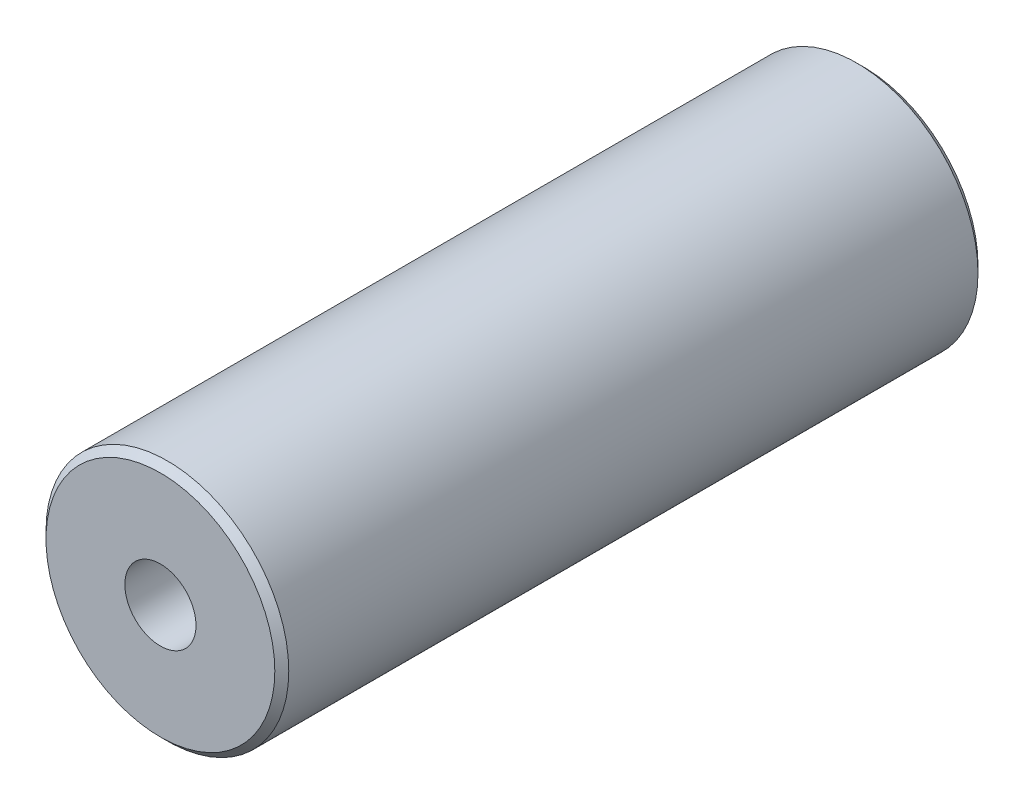
ISO-10303-21;
HEADER;
FILE_DESCRIPTION(('STEP AP214'),'2;1');
FILE_NAME('part.step','',(''),(''),'','','');
FILE_SCHEMA(('AUTOMOTIVE_DESIGN { 1 0 10303 214 1 1 1 1 }'));
ENDSEC;
DATA;
#1=APPLICATION_CONTEXT('core data for automotive mechanical design processes');
#2=APPLICATION_PROTOCOL_DEFINITION('international standard','automotive_design',2000,#1);
#3=PRODUCT_CONTEXT('',#1,'mechanical');
#4=PRODUCT('Part','Part','',(#3));
#5=PRODUCT_RELATED_PRODUCT_CATEGORY('part','',(#4));
#6=PRODUCT_DEFINITION_FORMATION('','',#4);
#7=PRODUCT_DEFINITION_CONTEXT('part definition',#1,'design');
#8=PRODUCT_DEFINITION('design','',#6,#7);
#9=PRODUCT_DEFINITION_SHAPE('','',#8);
#10=(LENGTH_UNIT() NAMED_UNIT(*) SI_UNIT(.MILLI.,.METRE.));
#11=(NAMED_UNIT(*) PLANE_ANGLE_UNIT() SI_UNIT($,.RADIAN.));
#12=(NAMED_UNIT(*) SI_UNIT($,.STERADIAN.) SOLID_ANGLE_UNIT());
#13=UNCERTAINTY_MEASURE_WITH_UNIT(LENGTH_MEASURE(1.E-05),#10,'distance_accuracy_value','');
#14=(GEOMETRIC_REPRESENTATION_CONTEXT(3) GLOBAL_UNCERTAINTY_ASSIGNED_CONTEXT((#13)) GLOBAL_UNIT_ASSIGNED_CONTEXT((#10,
#11,#12)) REPRESENTATION_CONTEXT('',''));
#15=CARTESIAN_POINT('',(0.,0.,0.));
#16=DIRECTION('',(0.,0.,1.));
#17=DIRECTION('',(1.,0.,0.));
#18=AXIS2_PLACEMENT_3D('',#15,#16,#17);
#19=CARTESIAN_POINT('',(0.,0.,25.2));
#20=DIRECTION('',(0.,0.,1.));
#21=DIRECTION('',(1.,0.,0.));
#22=AXIS2_PLACEMENT_3D('',#19,#20,#21);
#23=PLANE('',#22);
#24=CARTESIAN_POINT('',(0.,0.,25.2));
#25=DIRECTION('',(0.,0.,1.));
#26=DIRECTION('',(1.,0.,0.));
#27=AXIS2_PLACEMENT_3D('',#24,#25,#26);
#28=CIRCLE('',#27,8.2);
#29=CARTESIAN_POINT('',(8.2,0.,25.2));
#30=VERTEX_POINT('',#29);
#31=EDGE_CURVE('E10',#30,#30,#28,.T.);
#32=ORIENTED_EDGE('',*,*,#31,.T.);
#33=EDGE_LOOP('',(#32));
#34=FACE_BOUND('',#33,.T.);
#35=CARTESIAN_POINT('',(0.,0.,25.2));
#36=DIRECTION('',(0.,0.,1.));
#37=DIRECTION('',(1.,0.,0.));
#38=AXIS2_PLACEMENT_3D('',#35,#36,#37);
#39=CIRCLE('',#38,2.55);
#40=CARTESIAN_POINT('',(2.55,0.,25.2));
#41=VERTEX_POINT('',#40);
#42=EDGE_CURVE('E53',#41,#41,#39,.T.);
#43=ORIENTED_EDGE('',*,*,#42,.F.);
#44=EDGE_LOOP('',(#43));
#45=FACE_BOUND('',#44,.T.);
#46=ADVANCED_FACE('F34',(#34,#45),#23,.T.);
#47=CARTESIAN_POINT('',(0.,0.,25.2));
#48=DIRECTION('',(0.,0.,-1.));
#49=DIRECTION('',(-1.,0.,0.));
#50=AXIS2_PLACEMENT_3D('',#47,#48,#49);
#51=CYLINDRICAL_SURFACE('',#50,8.7);
#52=CARTESIAN_POINT('',(0.,0.,-24.7));
#53=DIRECTION('',(0.,0.,1.));
#54=DIRECTION('',(1.,0.,0.));
#55=AXIS2_PLACEMENT_3D('',#52,#53,#54);
#56=CIRCLE('',#55,8.7);
#57=CARTESIAN_POINT('',(8.70000000000001,0.,-24.7));
#58=VERTEX_POINT('',#57);
#59=EDGE_CURVE('E47',#58,#58,#56,.T.);
#60=ORIENTED_EDGE('',*,*,#59,.T.);
#61=EDGE_LOOP('',(#60));
#62=FACE_BOUND('',#61,.T.);
#63=CARTESIAN_POINT('',(0.,0.,24.7));
#64=DIRECTION('',(0.,0.,1.));
#65=DIRECTION('',(1.,0.,0.));
#66=AXIS2_PLACEMENT_3D('',#63,#64,#65);
#67=CIRCLE('',#66,8.7);
#68=CARTESIAN_POINT('',(8.7,0.,24.7));
#69=VERTEX_POINT('',#68);
#70=EDGE_CURVE('E69',#69,#69,#67,.F.);
#71=ORIENTED_EDGE('',*,*,#70,.T.);
#72=EDGE_LOOP('',(#71));
#73=FACE_BOUND('',#72,.T.);
#74=ADVANCED_FACE('F36',(#62,#73),#51,.T.);
#75=CARTESIAN_POINT('',(0.,0.,-25.2));
#76=DIRECTION('',(0.,0.,1.));
#77=DIRECTION('',(1.,0.,0.));
#78=AXIS2_PLACEMENT_3D('',#75,#76,#77);
#79=PLANE('',#78);
#80=CARTESIAN_POINT('',(0.,0.,-25.2));
#81=DIRECTION('',(0.,0.,1.));
#82=DIRECTION('',(1.,0.,0.));
#83=AXIS2_PLACEMENT_3D('',#80,#81,#82);
#84=CIRCLE('',#83,2.55);
#85=CARTESIAN_POINT('',(2.55000000000001,0.,-25.2));
#86=VERTEX_POINT('',#85);
#87=EDGE_CURVE('E64',#86,#86,#84,.T.);
#88=ORIENTED_EDGE('',*,*,#87,.T.);
#89=EDGE_LOOP('',(#88));
#90=FACE_BOUND('',#89,.T.);
#91=CARTESIAN_POINT('',(0.,0.,-25.2));
#92=DIRECTION('',(0.,0.,1.));
#93=DIRECTION('',(1.,0.,0.));
#94=AXIS2_PLACEMENT_3D('',#91,#92,#93);
#95=CIRCLE('',#94,8.2);
#96=CARTESIAN_POINT('',(8.20000000000001,0.,-25.2));
#97=VERTEX_POINT('',#96);
#98=EDGE_CURVE('E42',#97,#97,#95,.F.);
#99=ORIENTED_EDGE('',*,*,#98,.T.);
#100=EDGE_LOOP('',(#99));
#101=FACE_BOUND('',#100,.T.);
#102=ADVANCED_FACE('F79',(#90,#101),#79,.F.);
#103=CARTESIAN_POINT('',(0.,0.,-24.7));
#104=DIRECTION('',(0.,0.,1.));
#105=DIRECTION('',(1.,0.,0.));
#106=AXIS2_PLACEMENT_3D('',#103,#104,#105);
#107=CONICAL_SURFACE('',#106,8.7,0.785398163397445);
#108=ORIENTED_EDGE('',*,*,#98,.F.);
#109=EDGE_LOOP('',(#108));
#110=FACE_BOUND('',#109,.T.);
#111=ORIENTED_EDGE('',*,*,#59,.F.);
#112=EDGE_LOOP('',(#111));
#113=FACE_BOUND('',#112,.T.);
#114=ADVANCED_FACE('F76',(#110,#113),#107,.T.);
#115=CARTESIAN_POINT('',(0.,0.,25.2));
#116=DIRECTION('',(0.,0.,-1.));
#117=DIRECTION('',(-1.,0.,0.));
#118=AXIS2_PLACEMENT_3D('',#115,#116,#117);
#119=CONICAL_SURFACE('',#118,8.2,0.785398163397445);
#120=ORIENTED_EDGE('',*,*,#70,.F.);
#121=EDGE_LOOP('',(#120));
#122=FACE_BOUND('',#121,.T.);
#123=ORIENTED_EDGE('',*,*,#31,.F.);
#124=EDGE_LOOP('',(#123));
#125=FACE_BOUND('',#124,.T.);
#126=ADVANCED_FACE('F78',(#122,#125),#119,.T.);
#127=CARTESIAN_POINT('',(0.,0.,25.2));
#128=DIRECTION('',(0.,0.,-1.));
#129=DIRECTION('',(-1.,0.,0.));
#130=AXIS2_PLACEMENT_3D('',#127,#128,#129);
#131=CYLINDRICAL_SURFACE('',#130,2.55);
#132=ORIENTED_EDGE('',*,*,#42,.T.);
#133=EDGE_LOOP('',(#132));
#134=FACE_BOUND('',#133,.T.);
#135=CARTESIAN_POINT('',(0.,0.,15.2));
#136=DIRECTION('',(0.,0.,1.));
#137=DIRECTION('',(1.,0.,0.));
#138=AXIS2_PLACEMENT_3D('',#135,#136,#137);
#139=CIRCLE('',#138,2.55);
#140=CARTESIAN_POINT('',(2.55000000000001,0.,15.2));
#141=VERTEX_POINT('',#140);
#142=EDGE_CURVE('E50',#141,#141,#139,.F.);
#143=ORIENTED_EDGE('',*,*,#142,.T.);
#144=EDGE_LOOP('',(#143));
#145=FACE_BOUND('',#144,.T.);
#146=ADVANCED_FACE('F86',(#134,#145),#131,.F.);
#147=CARTESIAN_POINT('',(0.,0.,15.2));
#148=DIRECTION('',(0.,0.,1.));
#149=DIRECTION('',(1.,0.,0.));
#150=AXIS2_PLACEMENT_3D('',#147,#148,#149);
#151=PLANE('',#150);
#152=CARTESIAN_POINT('',(0.,0.,15.2));
#153=DIRECTION('',(0.,0.,1.));
#154=DIRECTION('',(1.,0.,0.));
#155=AXIS2_PLACEMENT_3D('',#152,#153,#154);
#156=CIRCLE('',#155,8.);
#157=CARTESIAN_POINT('',(8.00000000000001,0.,15.2));
#158=VERTEX_POINT('',#157);
#159=EDGE_CURVE('E57',#158,#158,#156,.T.);
#160=ORIENTED_EDGE('',*,*,#159,.F.);
#161=EDGE_LOOP('',(#160));
#162=FACE_BOUND('',#161,.T.);
#163=ORIENTED_EDGE('',*,*,#142,.F.);
#164=EDGE_LOOP('',(#163));
#165=FACE_BOUND('',#164,.T.);
#166=ADVANCED_FACE('F103',(#162,#165),#151,.F.);
#167=CARTESIAN_POINT('',(0.,0.,15.2));
#168=DIRECTION('',(0.,0.,-1.));
#169=DIRECTION('',(-1.,0.,0.));
#170=AXIS2_PLACEMENT_3D('',#167,#168,#169);
#171=CYLINDRICAL_SURFACE('',#170,8.);
#172=ORIENTED_EDGE('',*,*,#159,.T.);
#173=EDGE_LOOP('',(#172));
#174=FACE_BOUND('',#173,.T.);
#175=CARTESIAN_POINT('',(0.,0.,-15.2));
#176=DIRECTION('',(0.,0.,1.));
#177=DIRECTION('',(1.,0.,0.));
#178=AXIS2_PLACEMENT_3D('',#175,#176,#177);
#179=CIRCLE('',#178,8.);
#180=CARTESIAN_POINT('',(8.,0.,-15.2));
#181=VERTEX_POINT('',#180);
#182=EDGE_CURVE('E52',#181,#181,#179,.T.);
#183=ORIENTED_EDGE('',*,*,#182,.F.);
#184=EDGE_LOOP('',(#183));
#185=FACE_BOUND('',#184,.T.);
#186=ADVANCED_FACE('F99',(#174,#185),#171,.F.);
#187=CARTESIAN_POINT('',(0.,0.,-15.2));
#188=DIRECTION('',(0.,0.,1.));
#189=DIRECTION('',(1.,0.,0.));
#190=AXIS2_PLACEMENT_3D('',#187,#188,#189);
#191=PLANE('',#190);
#192=CARTESIAN_POINT('',(0.,0.,-15.2));
#193=DIRECTION('',(0.,0.,1.));
#194=DIRECTION('',(1.,0.,0.));
#195=AXIS2_PLACEMENT_3D('',#192,#193,#194);
#196=CIRCLE('',#195,2.55);
#197=CARTESIAN_POINT('',(2.55,0.,-15.2));
#198=VERTEX_POINT('',#197);
#199=EDGE_CURVE('E38',#198,#198,#196,.T.);
#200=ORIENTED_EDGE('',*,*,#199,.F.);
#201=EDGE_LOOP('',(#200));
#202=FACE_BOUND('',#201,.T.);
#203=ORIENTED_EDGE('',*,*,#182,.T.);
#204=EDGE_LOOP('',(#203));
#205=FACE_BOUND('',#204,.T.);
#206=ADVANCED_FACE('F102',(#202,#205),#191,.T.);
#207=CARTESIAN_POINT('',(0.,0.,-25.2));
#208=DIRECTION('',(0.,0.,1.));
#209=DIRECTION('',(1.,0.,0.));
#210=AXIS2_PLACEMENT_3D('',#207,#208,#209);
#211=CYLINDRICAL_SURFACE('',#210,2.55);
#212=ORIENTED_EDGE('',*,*,#199,.T.);
#213=EDGE_LOOP('',(#212));
#214=FACE_BOUND('',#213,.T.);
#215=ORIENTED_EDGE('',*,*,#87,.F.);
#216=EDGE_LOOP('',(#215));
#217=FACE_BOUND('',#216,.T.);
#218=ADVANCED_FACE('F108',(#214,#217),#211,.F.);
#219=CLOSED_SHELL('',(#46,#74,#102,#114,#126,#146,#166,#186,#206,#218));
#220=MANIFOLD_SOLID_BREP('B2',#219);
#221=ADVANCED_BREP_SHAPE_REPRESENTATION('',(#18,#220),#14);
#222=SHAPE_DEFINITION_REPRESENTATION(#9,#221);
ENDSEC;
END-ISO-10303-21;
